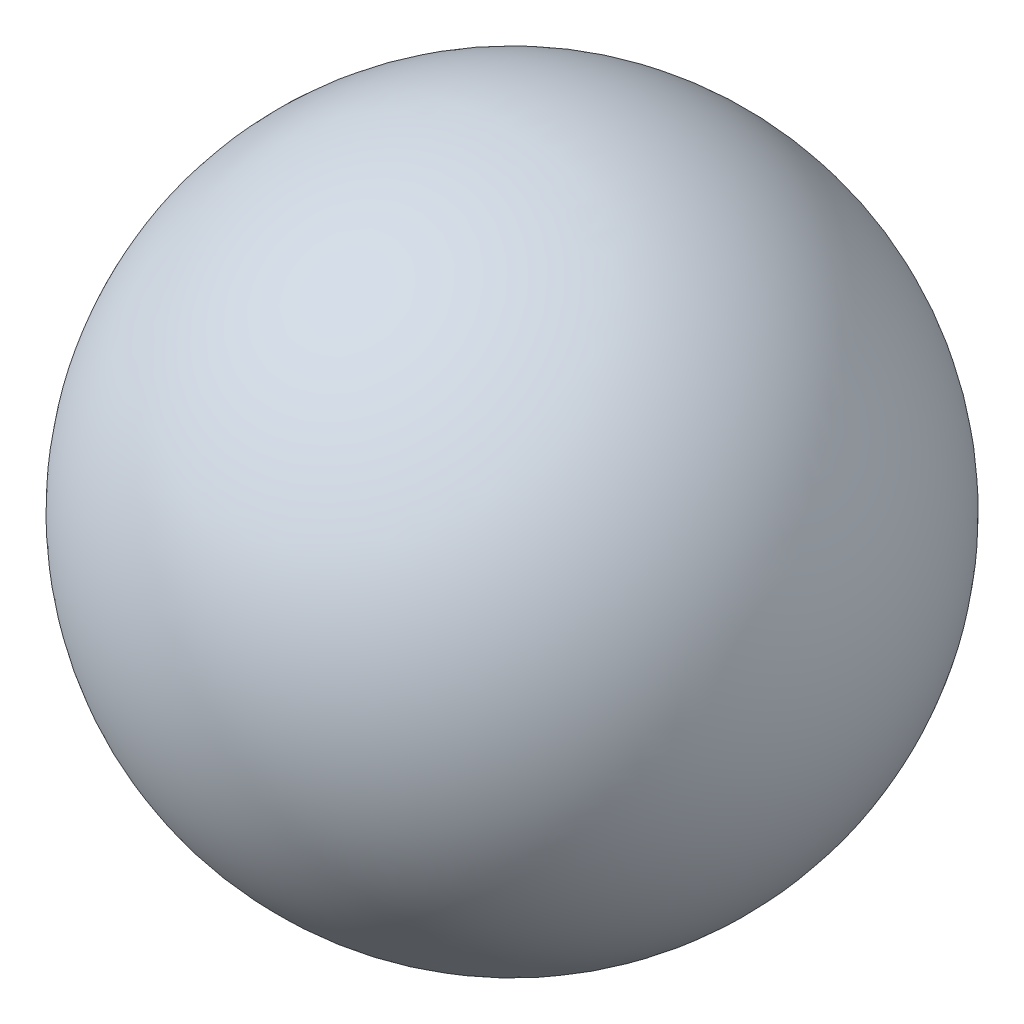
ISO-10303-21;
HEADER;
FILE_DESCRIPTION(('STEP AP214'),'2;1');
FILE_NAME('part.step','',(''),(''),'','','');
FILE_SCHEMA(('AUTOMOTIVE_DESIGN { 1 0 10303 214 1 1 1 1 }'));
ENDSEC;
DATA;
#1=APPLICATION_CONTEXT('core data for automotive mechanical design processes');
#2=APPLICATION_PROTOCOL_DEFINITION('international standard','automotive_design',2000,#1);
#3=PRODUCT_CONTEXT('',#1,'mechanical');
#4=PRODUCT('Part','Part','',(#3));
#5=PRODUCT_RELATED_PRODUCT_CATEGORY('part','',(#4));
#6=PRODUCT_DEFINITION_FORMATION('','',#4);
#7=PRODUCT_DEFINITION_CONTEXT('part definition',#1,'design');
#8=PRODUCT_DEFINITION('design','',#6,#7);
#9=PRODUCT_DEFINITION_SHAPE('','',#8);
#10=(LENGTH_UNIT() NAMED_UNIT(*) SI_UNIT(.MILLI.,.METRE.));
#11=(NAMED_UNIT(*) PLANE_ANGLE_UNIT() SI_UNIT($,.RADIAN.));
#12=(NAMED_UNIT(*) SI_UNIT($,.STERADIAN.) SOLID_ANGLE_UNIT());
#13=UNCERTAINTY_MEASURE_WITH_UNIT(LENGTH_MEASURE(1.E-05),#10,'distance_accuracy_value','');
#14=(GEOMETRIC_REPRESENTATION_CONTEXT(3) GLOBAL_UNCERTAINTY_ASSIGNED_CONTEXT((#13)) GLOBAL_UNIT_ASSIGNED_CONTEXT((#10,
#11,#12)) REPRESENTATION_CONTEXT('',''));
#15=CARTESIAN_POINT('',(0.,0.,0.));
#16=DIRECTION('',(0.,0.,1.));
#17=DIRECTION('',(1.,0.,0.));
#18=AXIS2_PLACEMENT_3D('',#15,#16,#17);
#19=CARTESIAN_POINT('',(0.,0.,0.));
#20=DIRECTION('',(1.,0.,0.));
#21=DIRECTION('',(0.,1.,0.));
#22=AXIS2_PLACEMENT_3D('',#19,#20,#21);
#23=SPHERICAL_SURFACE('',#22,0.15);
#24=CARTESIAN_POINT('',(-0.15,0.,0.));
#25=VERTEX_POINT('',#24);
#26=VERTEX_LOOP('',#25);
#27=FACE_BOUND('',#26,.T.);
#28=CARTESIAN_POINT('',(0.15,0.,0.));
#29=VERTEX_POINT('',#28);
#30=VERTEX_LOOP('',#29);
#31=FACE_BOUND('',#30,.T.);
#32=ADVANCED_FACE('F15',(#27,#31),#23,.T.);
#33=CLOSED_SHELL('',(#32));
#34=MANIFOLD_SOLID_BREP('B1',#33);
#35=ADVANCED_BREP_SHAPE_REPRESENTATION('',(#18,#34),#14);
#36=SHAPE_DEFINITION_REPRESENTATION(#9,#35);
ENDSEC;
END-ISO-10303-21;
